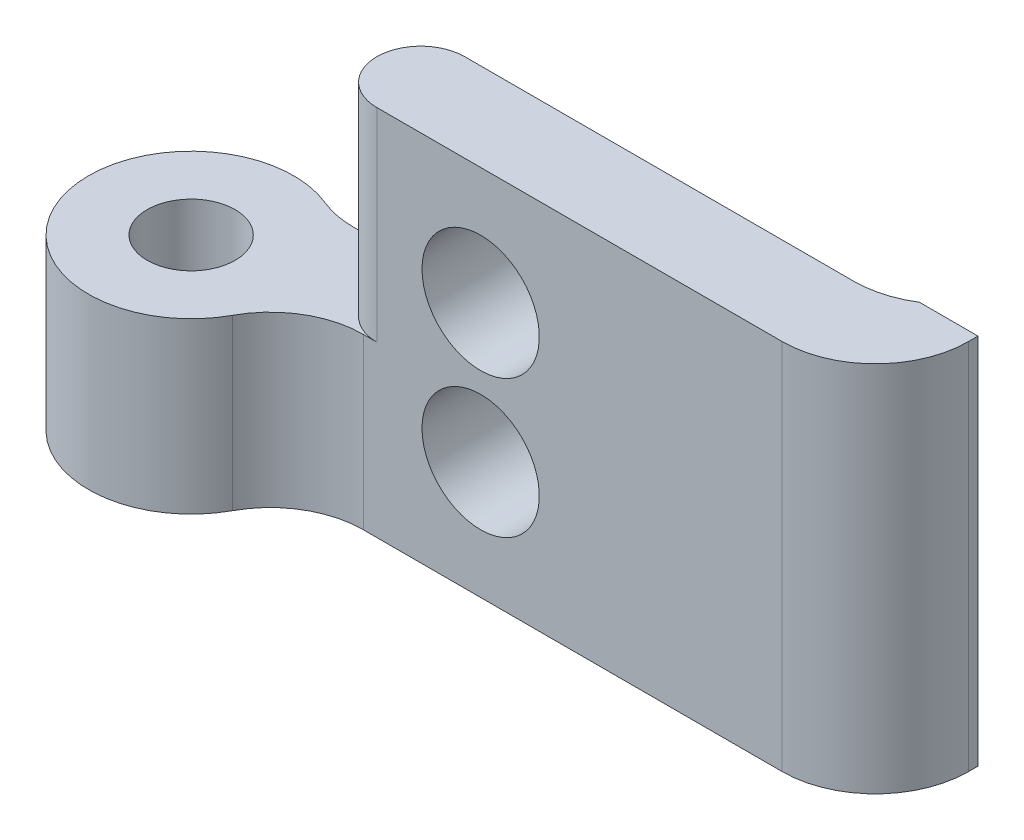
ISO-10303-21;
HEADER;
FILE_DESCRIPTION(('STEP AP214'),'2;1');
FILE_NAME('part.step','',(''),(''),'','','');
FILE_SCHEMA(('AUTOMOTIVE_DESIGN { 1 0 10303 214 1 1 1 1 }'));
ENDSEC;
DATA;
#1=APPLICATION_CONTEXT('core data for automotive mechanical design processes');
#2=APPLICATION_PROTOCOL_DEFINITION('international standard','automotive_design',2000,#1);
#3=PRODUCT_CONTEXT('',#1,'mechanical');
#4=PRODUCT('Part','Part','',(#3));
#5=PRODUCT_RELATED_PRODUCT_CATEGORY('part','',(#4));
#6=PRODUCT_DEFINITION_FORMATION('','',#4);
#7=PRODUCT_DEFINITION_CONTEXT('part definition',#1,'design');
#8=PRODUCT_DEFINITION('design','',#6,#7);
#9=PRODUCT_DEFINITION_SHAPE('','',#8);
#10=(LENGTH_UNIT() NAMED_UNIT(*) SI_UNIT(.MILLI.,.METRE.));
#11=(NAMED_UNIT(*) PLANE_ANGLE_UNIT() SI_UNIT($,.RADIAN.));
#12=(NAMED_UNIT(*) SI_UNIT($,.STERADIAN.) SOLID_ANGLE_UNIT());
#13=UNCERTAINTY_MEASURE_WITH_UNIT(LENGTH_MEASURE(1.E-05),#10,'distance_accuracy_value','');
#14=(GEOMETRIC_REPRESENTATION_CONTEXT(3) GLOBAL_UNCERTAINTY_ASSIGNED_CONTEXT((#13)) GLOBAL_UNIT_ASSIGNED_CONTEXT((#10,
#11,#12)) REPRESENTATION_CONTEXT('',''));
#15=CARTESIAN_POINT('',(0.,0.,0.));
#16=DIRECTION('',(0.,0.,1.));
#17=DIRECTION('',(1.,0.,0.));
#18=AXIS2_PLACEMENT_3D('',#15,#16,#17);
#19=CARTESIAN_POINT('',(-22.0637703059142,12.7,-11.2355470698206));
#20=DIRECTION('',(0.,-1.,0.));
#21=DIRECTION('',(0.,0.,-1.));
#22=AXIS2_PLACEMENT_3D('',#19,#20,#21);
#23=CYLINDRICAL_SURFACE('',#22,3.5);
#24=CARTESIAN_POINT('',(-22.0637703059142,5.77,-11.2355470698206));
#25=DIRECTION('',(0.,-1.,0.));
#26=DIRECTION('',(0.,0.,-1.));
#27=AXIS2_PLACEMENT_3D('',#24,#25,#26);
#28=CIRCLE('',#27,3.5);
#29=CARTESIAN_POINT('',(-18.9850593885621,5.77,-9.57075306233));
#30=VERTEX_POINT('',#29);
#31=CARTESIAN_POINT('',(-20.7346835195554,5.77,-14.4733747851764));
#32=VERTEX_POINT('',#31);
#33=EDGE_CURVE('E173',#30,#32,#28,.T.);
#34=ORIENTED_EDGE('',*,*,#33,.T.);
#35=DIRECTION('',(0.,-1.,0.));
#36=VECTOR('',#35,1.);
#37=CARTESIAN_POINT('',(-20.7346835195554,12.7,-14.4733747851764));
#38=LINE('',#37,#36);
#39=CARTESIAN_POINT('',(-20.7346835195554,0.,-14.4733747851764));
#40=VERTEX_POINT('',#39);
#41=EDGE_CURVE('E209',#32,#40,#38,.T.);
#42=ORIENTED_EDGE('',*,*,#41,.T.);
#43=CARTESIAN_POINT('',(-22.0637703059142,0.,-11.2355470698206));
#44=DIRECTION('',(0.,1.,0.));
#45=DIRECTION('',(0.,0.,1.));
#46=AXIS2_PLACEMENT_3D('',#43,#44,#45);
#47=CIRCLE('',#46,3.5);
#48=CARTESIAN_POINT('',(-18.9850593885621,0.,-9.57075306233));
#49=VERTEX_POINT('',#48);
#50=EDGE_CURVE('E178',#40,#49,#47,.T.);
#51=ORIENTED_EDGE('',*,*,#50,.T.);
#52=DIRECTION('',(0.,-1.,0.));
#53=VECTOR('',#52,1.);
#54=CARTESIAN_POINT('',(-18.9850593885621,12.7,-9.57075306233));
#55=LINE('',#54,#53);
#56=EDGE_CURVE('E207',#49,#30,#55,.F.);
#57=ORIENTED_EDGE('',*,*,#56,.T.);
#58=EDGE_LOOP('',(#34,#42,#51,#57));
#59=FACE_BOUND('',#58,.T.);
#60=ADVANCED_FACE('F35',(#59),#23,.T.);
#61=CARTESIAN_POINT('',(0.,12.7,-11.2355470698207));
#62=DIRECTION('',(0.,0.,-1.));
#63=DIRECTION('',(-1.,0.,0.));
#64=AXIS2_PLACEMENT_3D('',#61,#62,#63);
#65=PLANE('',#64);
#66=CARTESIAN_POINT('',(-12.1922287706784,4.,-11.2355470698206));
#67=DIRECTION('',(0.,0.,-1.));
#68=DIRECTION('',(-1.,0.,0.));
#69=AXIS2_PLACEMENT_3D('',#66,#67,#68);
#70=CIRCLE('',#69,2.);
#71=CARTESIAN_POINT('',(-14.1922287706784,4.,-11.2355470698206));
#72=VERTEX_POINT('',#71);
#73=EDGE_CURVE('E306',#72,#72,#70,.T.);
#74=ORIENTED_EDGE('',*,*,#73,.T.);
#75=EDGE_LOOP('',(#74));
#76=FACE_BOUND('',#75,.T.);
#77=CARTESIAN_POINT('',(-12.1922287706784,8.7,-11.2355470698206));
#78=DIRECTION('',(0.,0.,-1.));
#79=DIRECTION('',(-1.,0.,0.));
#80=AXIS2_PLACEMENT_3D('',#77,#78,#79);
#81=CIRCLE('',#80,2.);
#82=CARTESIAN_POINT('',(-14.1922287706784,8.7,-11.2355470698206));
#83=VERTEX_POINT('',#82);
#84=EDGE_CURVE('E144',#83,#83,#81,.T.);
#85=ORIENTED_EDGE('',*,*,#84,.T.);
#86=EDGE_LOOP('',(#85));
#87=FACE_BOUND('',#86,.T.);
#88=DIRECTION('',(1.,0.,0.));
#89=VECTOR('',#88,1.);
#90=CARTESIAN_POINT('',(0.,0.,-11.2355470698207));
#91=LINE('',#90,#89);
#92=CARTESIAN_POINT('',(-16.1922287706784,0.,-11.2355470698206));
#93=VERTEX_POINT('',#92);
#94=CARTESIAN_POINT('',(-1.90855751243395,0.,-11.2355470698207));
#95=VERTEX_POINT('',#94);
#96=EDGE_CURVE('E188',#93,#95,#91,.T.);
#97=ORIENTED_EDGE('',*,*,#96,.T.);
#98=DIRECTION('',(0.,-1.,0.));
#99=VECTOR('',#98,1.);
#100=CARTESIAN_POINT('',(-1.90855751243395,12.7,-11.2355470698207));
#101=LINE('',#100,#99);
#102=CARTESIAN_POINT('',(-1.90855751243395,12.7,-11.2355470698207));
#103=VERTEX_POINT('',#102);
#104=EDGE_CURVE('E203',#95,#103,#101,.F.);
#105=ORIENTED_EDGE('',*,*,#104,.T.);
#106=DIRECTION('',(1.,0.,0.));
#107=VECTOR('',#106,1.);
#108=CARTESIAN_POINT('',(0.,12.7,-11.2355470698207));
#109=LINE('',#108,#107);
#110=CARTESIAN_POINT('',(-15.733557512434,12.7,-11.2355470698206));
#111=VERTEX_POINT('',#110);
#112=EDGE_CURVE('E179',#111,#103,#109,.T.);
#113=ORIENTED_EDGE('',*,*,#112,.F.);
#114=DIRECTION('',(0.,1.,0.));
#115=VECTOR('',#114,1.);
#116=CARTESIAN_POINT('',(-15.733557512434,-15.0292733015078,-11.2355470698206));
#117=LINE('',#116,#115);
#118=CARTESIAN_POINT('',(-15.733557512434,5.77,-11.2355470698206));
#119=VERTEX_POINT('',#118);
#120=EDGE_CURVE('E171',#119,#111,#117,.T.);
#121=ORIENTED_EDGE('',*,*,#120,.F.);
#122=DIRECTION('',(-1.,0.,0.));
#123=VECTOR('',#122,1.);
#124=CARTESIAN_POINT('',(0.,5.77,-11.2355470698207));
#125=LINE('',#124,#123);
#126=CARTESIAN_POINT('',(-16.1922287706784,5.77,-11.2355470698206));
#127=VERTEX_POINT('',#126);
#128=EDGE_CURVE('E175',#119,#127,#125,.T.);
#129=ORIENTED_EDGE('',*,*,#128,.T.);
#130=DIRECTION('',(0.,1.,0.));
#131=VECTOR('',#130,1.);
#132=CARTESIAN_POINT('',(-16.1922287706784,0.,-11.2355470698206));
#133=LINE('',#132,#131);
#134=EDGE_CURVE('E200',#127,#93,#133,.F.);
#135=ORIENTED_EDGE('',*,*,#134,.T.);
#136=EDGE_LOOP('',(#97,#105,#113,#121,#129,#135));
#137=FACE_BOUND('',#136,.T.);
#138=ADVANCED_FACE('F230',(#76,#87,#137),#65,.F.);
#139=CARTESIAN_POINT('',(1.26644248756605,12.7,0.));
#140=DIRECTION('',(-1.,0.,0.));
#141=DIRECTION('',(0.,0.,1.));
#142=AXIS2_PLACEMENT_3D('',#139,#140,#141);
#143=PLANE('',#142);
#144=DIRECTION('',(0.,0.,-1.));
#145=VECTOR('',#144,1.);
#146=CARTESIAN_POINT('',(1.26644248756605,12.7,0.));
#147=LINE('',#146,#145);
#148=CARTESIAN_POINT('',(1.26644248756605,12.7,-14.4105470698207));
#149=VERTEX_POINT('',#148);
#150=CARTESIAN_POINT('',(1.26644248756605,12.7,-14.7355470698207));
#151=VERTEX_POINT('',#150);
#152=EDGE_CURVE('E142',#149,#151,#147,.T.);
#153=ORIENTED_EDGE('',*,*,#152,.F.);
#154=DIRECTION('',(0.,-1.,0.));
#155=VECTOR('',#154,1.);
#156=CARTESIAN_POINT('',(1.26644248756605,12.7,-14.4105470698207));
#157=LINE('',#156,#155);
#158=CARTESIAN_POINT('',(1.26644248756605,0.,-14.4105470698207));
#159=VERTEX_POINT('',#158);
#160=EDGE_CURVE('E195',#149,#159,#157,.T.);
#161=ORIENTED_EDGE('',*,*,#160,.T.);
#162=DIRECTION('',(0.,0.,-1.));
#163=VECTOR('',#162,1.);
#164=CARTESIAN_POINT('',(1.26644248756605,0.,0.));
#165=LINE('',#164,#163);
#166=CARTESIAN_POINT('',(1.26644248756605,0.,-14.7355470698207));
#167=VERTEX_POINT('',#166);
#168=EDGE_CURVE('E191',#159,#167,#165,.T.);
#169=ORIENTED_EDGE('',*,*,#168,.T.);
#170=DIRECTION('',(0.,1.,0.));
#171=VECTOR('',#170,1.);
#172=CARTESIAN_POINT('',(1.26644248756605,-3.77253374436471,-14.7355470698207));
#173=LINE('',#172,#171);
#174=EDGE_CURVE('E151',#167,#151,#173,.T.);
#175=ORIENTED_EDGE('',*,*,#174,.T.);
#176=EDGE_LOOP('',(#153,#161,#169,#175));
#177=FACE_BOUND('',#176,.T.);
#178=ADVANCED_FACE('F241',(#177),#143,.F.);
#179=CARTESIAN_POINT('',(0.,12.7,-14.2355470698207));
#180=DIRECTION('',(0.,0.,1.));
#181=DIRECTION('',(1.,0.,0.));
#182=AXIS2_PLACEMENT_3D('',#179,#180,#181);
#183=PLANE('',#182);
#184=CARTESIAN_POINT('',(-4.73355751243397,6.35,-14.2355470698207));
#185=DIRECTION('',(0.,0.,-1.));
#186=DIRECTION('',(-1.,0.,0.));
#187=AXIS2_PLACEMENT_3D('',#184,#185,#186);
#188=CIRCLE('',#187,1.585);
#189=CARTESIAN_POINT('',(-6.31855751243397,6.35,-14.2355470698207));
#190=VERTEX_POINT('',#189);
#191=EDGE_CURVE('E303',#190,#190,#188,.T.);
#192=ORIENTED_EDGE('',*,*,#191,.F.);
#193=EDGE_LOOP('',(#192));
#194=FACE_BOUND('',#193,.T.);
#195=CARTESIAN_POINT('',(-12.1922287706784,4.,-14.2355470698206));
#196=DIRECTION('',(0.,0.,-1.));
#197=DIRECTION('',(-1.,0.,0.));
#198=AXIS2_PLACEMENT_3D('',#195,#196,#197);
#199=CIRCLE('',#198,2.);
#200=CARTESIAN_POINT('',(-14.1922287706784,4.,-14.2355470698206));
#201=VERTEX_POINT('',#200);
#202=EDGE_CURVE('E302',#201,#201,#199,.T.);
#203=ORIENTED_EDGE('',*,*,#202,.F.);
#204=EDGE_LOOP('',(#203));
#205=FACE_BOUND('',#204,.T.);
#206=CARTESIAN_POINT('',(-12.1922287706784,8.7,-14.2355470698206));
#207=DIRECTION('',(0.,0.,-1.));
#208=DIRECTION('',(-1.,0.,0.));
#209=AXIS2_PLACEMENT_3D('',#206,#207,#208);
#210=CIRCLE('',#209,2.);
#211=CARTESIAN_POINT('',(-14.1922287706784,8.7,-14.2355470698206));
#212=VERTEX_POINT('',#211);
#213=EDGE_CURVE('E147',#212,#212,#210,.T.);
#214=ORIENTED_EDGE('',*,*,#213,.F.);
#215=EDGE_LOOP('',(#214));
#216=FACE_BOUND('',#215,.T.);
#217=DIRECTION('',(-1.,0.,0.));
#218=VECTOR('',#217,1.);
#219=CARTESIAN_POINT('',(0.,0.,-14.2355470698207));
#220=LINE('',#219,#218);
#221=CARTESIAN_POINT('',(-2.47281022552656,0.,-14.2355470698207));
#222=VERTEX_POINT('',#221);
#223=CARTESIAN_POINT('',(-19.529011934787,0.,-14.2355470698206));
#224=VERTEX_POINT('',#223);
#225=EDGE_CURVE('E181',#222,#224,#220,.T.);
#226=ORIENTED_EDGE('',*,*,#225,.T.);
#227=DIRECTION('',(0.,1.,0.));
#228=VECTOR('',#227,1.);
#229=CARTESIAN_POINT('',(-19.529011934787,5.77,-14.2355470698206));
#230=LINE('',#229,#228);
#231=CARTESIAN_POINT('',(-19.529011934787,5.77,-14.2355470698206));
#232=VERTEX_POINT('',#231);
#233=EDGE_CURVE('E50',#224,#232,#230,.T.);
#234=ORIENTED_EDGE('',*,*,#233,.T.);
#235=DIRECTION('',(1.,0.,0.));
#236=VECTOR('',#235,1.);
#237=CARTESIAN_POINT('',(0.,5.77,-14.2355470698207));
#238=LINE('',#237,#236);
#239=CARTESIAN_POINT('',(-15.733557512434,5.77,-14.2355470698206));
#240=VERTEX_POINT('',#239);
#241=EDGE_CURVE('E185',#232,#240,#238,.T.);
#242=ORIENTED_EDGE('',*,*,#241,.T.);
#243=DIRECTION('',(0.,1.,0.));
#244=VECTOR('',#243,1.);
#245=CARTESIAN_POINT('',(-15.733557512434,-15.0292733015078,-14.2355470698206));
#246=LINE('',#245,#244);
#247=CARTESIAN_POINT('',(-15.733557512434,12.7,-14.2355470698206));
#248=VERTEX_POINT('',#247);
#249=EDGE_CURVE('E168',#240,#248,#246,.T.);
#250=ORIENTED_EDGE('',*,*,#249,.T.);
#251=DIRECTION('',(-1.,0.,0.));
#252=VECTOR('',#251,1.);
#253=CARTESIAN_POINT('',(0.,12.7,-14.2355470698207));
#254=LINE('',#253,#252);
#255=CARTESIAN_POINT('',(-2.47281022552656,12.7,-14.2355470698207));
#256=VERTEX_POINT('',#255);
#257=EDGE_CURVE('E183',#256,#248,#254,.T.);
#258=ORIENTED_EDGE('',*,*,#257,.F.);
#259=DIRECTION('',(0.,1.,0.));
#260=VECTOR('',#259,1.);
#261=CARTESIAN_POINT('',(-2.47281022552656,-3.77253374436471,-14.2355470698207));
#262=LINE('',#261,#260);
#263=EDGE_CURVE('E130',#222,#256,#262,.T.);
#264=ORIENTED_EDGE('',*,*,#263,.F.);
#265=EDGE_LOOP('',(#226,#234,#242,#250,#258,#264));
#266=FACE_BOUND('',#265,.T.);
#267=ADVANCED_FACE('F237',(#194,#205,#216,#266),#183,.F.);
#268=CARTESIAN_POINT('',(0.,12.7,0.));
#269=DIRECTION('',(0.,1.,0.));
#270=DIRECTION('',(0.,0.,1.));
#271=AXIS2_PLACEMENT_3D('',#268,#269,#270);
#272=PLANE('',#271);
#273=ORIENTED_EDGE('',*,*,#112,.T.);
#274=CARTESIAN_POINT('',(-1.90855751243395,12.7,-14.4105470698207));
#275=DIRECTION('',(0.,1.,0.));
#276=DIRECTION('',(0.,0.,1.));
#277=AXIS2_PLACEMENT_3D('',#274,#275,#276);
#278=CIRCLE('',#277,3.175);
#279=EDGE_CURVE('E205',#103,#149,#278,.T.);
#280=ORIENTED_EDGE('',*,*,#279,.T.);
#281=ORIENTED_EDGE('',*,*,#152,.T.);
#282=DIRECTION('',(-1.,0.,0.));
#283=VECTOR('',#282,1.);
#284=CARTESIAN_POINT('',(0.,12.7,-14.7355470698207));
#285=LINE('',#284,#283);
#286=CARTESIAN_POINT('',(-0.73355751243395,12.7,-14.7355470698207));
#287=VERTEX_POINT('',#286);
#288=EDGE_CURVE('E125',#151,#287,#285,.T.);
#289=ORIENTED_EDGE('',*,*,#288,.T.);
#290=CARTESIAN_POINT('',(-2.47281022552656,12.7,-17.5105470698206));
#291=DIRECTION('',(0.,1.,0.));
#292=DIRECTION('',(0.,0.,1.));
#293=AXIS2_PLACEMENT_3D('',#290,#291,#292);
#294=CIRCLE('',#293,3.275);
#295=EDGE_CURVE('E131',#287,#256,#294,.F.);
#296=ORIENTED_EDGE('',*,*,#295,.T.);
#297=ORIENTED_EDGE('',*,*,#257,.T.);
#298=CARTESIAN_POINT('',(-15.733557512434,12.7,-12.7355470698206));
#299=DIRECTION('',(0.,1.,0.));
#300=DIRECTION('',(0.,0.,1.));
#301=AXIS2_PLACEMENT_3D('',#298,#299,#300);
#302=CIRCLE('',#301,1.5);
#303=EDGE_CURVE('E160',#111,#248,#302,.F.);
#304=ORIENTED_EDGE('',*,*,#303,.F.);
#305=EDGE_LOOP('',(#273,#280,#281,#289,#296,#297,#304));
#306=FACE_BOUND('',#305,.T.);
#307=ADVANCED_FACE('F140',(#306),#272,.T.);
#308=CARTESIAN_POINT('',(0.,0.,0.));
#309=DIRECTION('',(0.,1.,0.));
#310=DIRECTION('',(0.,0.,1.));
#311=AXIS2_PLACEMENT_3D('',#308,#309,#310);
#312=PLANE('',#311);
#313=CARTESIAN_POINT('',(-22.0637703059142,0.,-11.2355470698206));
#314=DIRECTION('',(0.,1.,0.));
#315=DIRECTION('',(0.,0.,1.));
#316=AXIS2_PLACEMENT_3D('',#313,#314,#315);
#317=CIRCLE('',#316,1.5);
#318=CARTESIAN_POINT('',(-22.0637703059142,0.,-9.73554706982062));
#319=VERTEX_POINT('',#318);
#320=EDGE_CURVE('E157',#319,#319,#317,.T.);
#321=ORIENTED_EDGE('',*,*,#320,.T.);
#322=EDGE_LOOP('',(#321));
#323=FACE_BOUND('',#322,.T.);
#324=ORIENTED_EDGE('',*,*,#168,.F.);
#325=CARTESIAN_POINT('',(-1.90855751243395,0.,-14.4105470698207));
#326=DIRECTION('',(0.,1.,0.));
#327=DIRECTION('',(0.,0.,1.));
#328=AXIS2_PLACEMENT_3D('',#325,#326,#327);
#329=CIRCLE('',#328,3.175);
#330=EDGE_CURVE('E198',#159,#95,#329,.F.);
#331=ORIENTED_EDGE('',*,*,#330,.T.);
#332=ORIENTED_EDGE('',*,*,#96,.F.);
#333=CARTESIAN_POINT('',(-16.1922287706784,0.,-8.06054706982065));
#334=DIRECTION('',(0.,1.,0.));
#335=DIRECTION('',(0.,0.,1.));
#336=AXIS2_PLACEMENT_3D('',#333,#334,#335);
#337=CIRCLE('',#336,3.175);
#338=EDGE_CURVE('E43',#93,#49,#337,.T.);
#339=ORIENTED_EDGE('',*,*,#338,.T.);
#340=ORIENTED_EDGE('',*,*,#50,.F.);
#341=CARTESIAN_POINT('',(-19.529011934787,0.,-17.4105470698206));
#342=DIRECTION('',(0.,1.,0.));
#343=DIRECTION('',(0.,0.,1.));
#344=AXIS2_PLACEMENT_3D('',#341,#342,#343);
#345=CIRCLE('',#344,3.175);
#346=EDGE_CURVE('E213',#40,#224,#345,.T.);
#347=ORIENTED_EDGE('',*,*,#346,.T.);
#348=ORIENTED_EDGE('',*,*,#225,.F.);
#349=CARTESIAN_POINT('',(-2.47281022552656,0.,-17.5105470698206));
#350=DIRECTION('',(0.,1.,0.));
#351=DIRECTION('',(0.,0.,1.));
#352=AXIS2_PLACEMENT_3D('',#349,#350,#351);
#353=CIRCLE('',#352,3.275);
#354=CARTESIAN_POINT('',(-0.73355751243395,0.,-14.7355470698207));
#355=VERTEX_POINT('',#354);
#356=EDGE_CURVE('E154',#222,#355,#353,.T.);
#357=ORIENTED_EDGE('',*,*,#356,.T.);
#358=DIRECTION('',(1.,0.,0.));
#359=VECTOR('',#358,1.);
#360=CARTESIAN_POINT('',(0.,0.,-14.7355470698207));
#361=LINE('',#360,#359);
#362=EDGE_CURVE('E127',#355,#167,#361,.T.);
#363=ORIENTED_EDGE('',*,*,#362,.T.);
#364=EDGE_LOOP('',(#324,#331,#332,#339,#340,#347,#348,#357,#363));
#365=FACE_BOUND('',#364,.T.);
#366=ADVANCED_FACE('F219',(#323,#365),#312,.F.);
#367=CARTESIAN_POINT('',(-22.0637703059142,5.77,-11.2355470698206));
#368=DIRECTION('',(0.,-1.,0.));
#369=DIRECTION('',(-0.707106781186548,0.,-0.707106781186547));
#370=AXIS2_PLACEMENT_3D('',#367,#368,#369);
#371=PLANE('',#370);
#372=CARTESIAN_POINT('',(-22.0637703059142,5.77,-11.2355470698206));
#373=DIRECTION('',(0.,1.,0.));
#374=DIRECTION('',(0.,0.,1.));
#375=AXIS2_PLACEMENT_3D('',#372,#373,#374);
#376=CIRCLE('',#375,1.5);
#377=CARTESIAN_POINT('',(-22.0637703059142,5.77,-9.73554706982062));
#378=VERTEX_POINT('',#377);
#379=EDGE_CURVE('E156',#378,#378,#376,.T.);
#380=ORIENTED_EDGE('',*,*,#379,.F.);
#381=EDGE_LOOP('',(#380));
#382=FACE_BOUND('',#381,.T.);
#383=CARTESIAN_POINT('',(-15.733557512434,5.77,-12.7355470698206));
#384=DIRECTION('',(0.,-1.,0.));
#385=DIRECTION('',(0.,0.,-1.));
#386=AXIS2_PLACEMENT_3D('',#383,#384,#385);
#387=CIRCLE('',#386,1.5);
#388=EDGE_CURVE('E165',#119,#240,#387,.T.);
#389=ORIENTED_EDGE('',*,*,#388,.T.);
#390=ORIENTED_EDGE('',*,*,#241,.F.);
#391=CARTESIAN_POINT('',(-19.529011934787,5.77,-17.4105470698206));
#392=DIRECTION('',(0.,-1.,0.));
#393=DIRECTION('',(0.,0.,-1.));
#394=AXIS2_PLACEMENT_3D('',#391,#392,#393);
#395=CIRCLE('',#394,3.175);
#396=EDGE_CURVE('E57',#232,#32,#395,.T.);
#397=ORIENTED_EDGE('',*,*,#396,.T.);
#398=ORIENTED_EDGE('',*,*,#33,.F.);
#399=CARTESIAN_POINT('',(-16.1922287706784,5.77,-8.06054706982065));
#400=DIRECTION('',(0.,-1.,0.));
#401=DIRECTION('',(0.,0.,-1.));
#402=AXIS2_PLACEMENT_3D('',#399,#400,#401);
#403=CIRCLE('',#402,3.175);
#404=EDGE_CURVE('E11',#30,#127,#403,.T.);
#405=ORIENTED_EDGE('',*,*,#404,.T.);
#406=ORIENTED_EDGE('',*,*,#128,.F.);
#407=EDGE_LOOP('',(#389,#390,#397,#398,#405,#406));
#408=FACE_BOUND('',#407,.T.);
#409=ADVANCED_FACE('F226',(#382,#408),#371,.F.);
#410=CARTESIAN_POINT('',(-15.733557512434,-15.0292733015078,-12.7355470698206));
#411=DIRECTION('',(0.,1.,0.));
#412=DIRECTION('',(0.,0.,1.));
#413=AXIS2_PLACEMENT_3D('',#410,#411,#412);
#414=CYLINDRICAL_SURFACE('',#413,1.5);
#415=ORIENTED_EDGE('',*,*,#120,.T.);
#416=ORIENTED_EDGE('',*,*,#303,.T.);
#417=ORIENTED_EDGE('',*,*,#249,.F.);
#418=ORIENTED_EDGE('',*,*,#388,.F.);
#419=EDGE_LOOP('',(#415,#416,#417,#418));
#420=FACE_BOUND('',#419,.T.);
#421=ADVANCED_FACE('F234',(#420),#414,.T.);
#422=CARTESIAN_POINT('',(-22.0637703059142,0.,-11.2355470698206));
#423=DIRECTION('',(0.,1.,0.));
#424=DIRECTION('',(0.,0.,1.));
#425=AXIS2_PLACEMENT_3D('',#422,#423,#424);
#426=CYLINDRICAL_SURFACE('',#425,1.5);
#427=ORIENTED_EDGE('',*,*,#320,.F.);
#428=EDGE_LOOP('',(#427));
#429=FACE_BOUND('',#428,.T.);
#430=ORIENTED_EDGE('',*,*,#379,.T.);
#431=EDGE_LOOP('',(#430));
#432=FACE_BOUND('',#431,.T.);
#433=ADVANCED_FACE('F276',(#429,#432),#426,.F.);
#434=CARTESIAN_POINT('',(0.,-3.77253374436471,-14.7355470698207));
#435=DIRECTION('',(0.,0.,-1.));
#436=DIRECTION('',(-1.,0.,0.));
#437=AXIS2_PLACEMENT_3D('',#434,#435,#436);
#438=PLANE('',#437);
#439=ORIENTED_EDGE('',*,*,#362,.F.);
#440=DIRECTION('',(0.,1.,0.));
#441=VECTOR('',#440,1.);
#442=CARTESIAN_POINT('',(-0.73355751243395,-3.77253374436471,-14.7355470698207));
#443=LINE('',#442,#441);
#444=EDGE_CURVE('E120',#355,#287,#443,.T.);
#445=ORIENTED_EDGE('',*,*,#444,.T.);
#446=ORIENTED_EDGE('',*,*,#288,.F.);
#447=ORIENTED_EDGE('',*,*,#174,.F.);
#448=EDGE_LOOP('',(#439,#445,#446,#447));
#449=FACE_BOUND('',#448,.T.);
#450=ADVANCED_FACE('F122',(#449),#438,.T.);
#451=CARTESIAN_POINT('',(-2.47281022552656,-3.77253374436471,-17.5105470698206));
#452=DIRECTION('',(0.,1.,0.));
#453=DIRECTION('',(0.,0.,1.));
#454=AXIS2_PLACEMENT_3D('',#451,#452,#453);
#455=CYLINDRICAL_SURFACE('',#454,3.275);
#456=ORIENTED_EDGE('',*,*,#356,.F.);
#457=ORIENTED_EDGE('',*,*,#263,.T.);
#458=ORIENTED_EDGE('',*,*,#295,.F.);
#459=ORIENTED_EDGE('',*,*,#444,.F.);
#460=EDGE_LOOP('',(#456,#457,#458,#459));
#461=FACE_BOUND('',#460,.T.);
#462=ADVANCED_FACE('F135',(#461),#455,.F.);
#463=CARTESIAN_POINT('',(-1.90855751243395,12.7,-14.4105470698207));
#464=DIRECTION('',(0.,-1.,0.));
#465=DIRECTION('',(0.,0.,-1.));
#466=AXIS2_PLACEMENT_3D('',#463,#464,#465);
#467=CYLINDRICAL_SURFACE('',#466,3.175);
#468=ORIENTED_EDGE('',*,*,#279,.F.);
#469=ORIENTED_EDGE('',*,*,#104,.F.);
#470=ORIENTED_EDGE('',*,*,#330,.F.);
#471=ORIENTED_EDGE('',*,*,#160,.F.);
#472=EDGE_LOOP('',(#468,#469,#470,#471));
#473=FACE_BOUND('',#472,.T.);
#474=ADVANCED_FACE('F244',(#473),#467,.T.);
#475=CARTESIAN_POINT('',(-19.529011934787,12.7,-17.4105470698206));
#476=DIRECTION('',(0.,-1.,0.));
#477=DIRECTION('',(0.,0.,-1.));
#478=AXIS2_PLACEMENT_3D('',#475,#476,#477);
#479=CYLINDRICAL_SURFACE('',#478,3.175);
#480=ORIENTED_EDGE('',*,*,#396,.F.);
#481=ORIENTED_EDGE('',*,*,#233,.F.);
#482=ORIENTED_EDGE('',*,*,#346,.F.);
#483=ORIENTED_EDGE('',*,*,#41,.F.);
#484=EDGE_LOOP('',(#480,#481,#482,#483));
#485=FACE_BOUND('',#484,.T.);
#486=ADVANCED_FACE('F239',(#485),#479,.F.);
#487=CARTESIAN_POINT('',(-16.1922287706784,12.7,-8.06054706982065));
#488=DIRECTION('',(0.,-1.,0.));
#489=DIRECTION('',(0.,0.,-1.));
#490=AXIS2_PLACEMENT_3D('',#487,#488,#489);
#491=CYLINDRICAL_SURFACE('',#490,3.175);
#492=ORIENTED_EDGE('',*,*,#404,.F.);
#493=ORIENTED_EDGE('',*,*,#56,.F.);
#494=ORIENTED_EDGE('',*,*,#338,.F.);
#495=ORIENTED_EDGE('',*,*,#134,.F.);
#496=EDGE_LOOP('',(#492,#493,#494,#495));
#497=FACE_BOUND('',#496,.T.);
#498=ADVANCED_FACE('F37',(#497),#491,.F.);
#499=CARTESIAN_POINT('',(-12.1922287706784,8.7,-4.23554706982065));
#500=DIRECTION('',(0.,0.,-1.));
#501=DIRECTION('',(-1.,0.,0.));
#502=AXIS2_PLACEMENT_3D('',#499,#500,#501);
#503=CYLINDRICAL_SURFACE('',#502,2.);
#504=ORIENTED_EDGE('',*,*,#213,.T.);
#505=EDGE_LOOP('',(#504));
#506=FACE_BOUND('',#505,.T.);
#507=ORIENTED_EDGE('',*,*,#84,.F.);
#508=EDGE_LOOP('',(#507));
#509=FACE_BOUND('',#508,.T.);
#510=ADVANCED_FACE('F282',(#506,#509),#503,.F.);
#511=CARTESIAN_POINT('',(-12.1922287706784,4.,-4.23554706982065));
#512=DIRECTION('',(0.,0.,-1.));
#513=DIRECTION('',(-1.,0.,0.));
#514=AXIS2_PLACEMENT_3D('',#511,#512,#513);
#515=CYLINDRICAL_SURFACE('',#514,2.);
#516=ORIENTED_EDGE('',*,*,#202,.T.);
#517=EDGE_LOOP('',(#516));
#518=FACE_BOUND('',#517,.T.);
#519=ORIENTED_EDGE('',*,*,#73,.F.);
#520=EDGE_LOOP('',(#519));
#521=FACE_BOUND('',#520,.T.);
#522=ADVANCED_FACE('F285',(#518,#521),#515,.F.);
#523=CARTESIAN_POINT('',(-4.73355751243397,6.35,-12.7355470698207));
#524=DIRECTION('',(0.,0.,-1.));
#525=DIRECTION('',(-1.,0.,0.));
#526=AXIS2_PLACEMENT_3D('',#523,#524,#525);
#527=CYLINDRICAL_SURFACE('',#526,1.585);
#528=CARTESIAN_POINT('',(-4.73355751243397,6.35,-12.7355470698207));
#529=DIRECTION('',(0.,0.,-1.));
#530=DIRECTION('',(-1.,0.,0.));
#531=AXIS2_PLACEMENT_3D('',#528,#529,#530);
#532=CIRCLE('',#531,1.585);
#533=CARTESIAN_POINT('',(-6.31855751243397,6.35,-12.7355470698207));
#534=VERTEX_POINT('',#533);
#535=EDGE_CURVE('E301',#534,#534,#532,.T.);
#536=ORIENTED_EDGE('',*,*,#535,.F.);
#537=EDGE_LOOP('',(#536));
#538=FACE_BOUND('',#537,.T.);
#539=ORIENTED_EDGE('',*,*,#191,.T.);
#540=EDGE_LOOP('',(#539));
#541=FACE_BOUND('',#540,.T.);
#542=ADVANCED_FACE('F289',(#538,#541),#527,.F.);
#543=CARTESIAN_POINT('',(-4.73355751243397,6.35,-12.7355470698207));
#544=DIRECTION('',(0.,0.,-1.));
#545=DIRECTION('',(-1.,0.,0.));
#546=AXIS2_PLACEMENT_3D('',#543,#544,#545);
#547=PLANE('',#546);
#548=ORIENTED_EDGE('',*,*,#535,.T.);
#549=EDGE_LOOP('',(#548));
#550=FACE_BOUND('',#549,.T.);
#551=ADVANCED_FACE('F293',(#550),#547,.T.);
#552=CLOSED_SHELL('',(#60,#138,#178,#267,#307,#366,#409,#421,#433,#450,#462,#474,#486,#498,#510,
#522,#542,#551));
#553=MANIFOLD_SOLID_BREP('B2',#552);
#554=ADVANCED_BREP_SHAPE_REPRESENTATION('',(#18,#553),#14);
#555=SHAPE_DEFINITION_REPRESENTATION(#9,#554);
ENDSEC;
END-ISO-10303-21;
